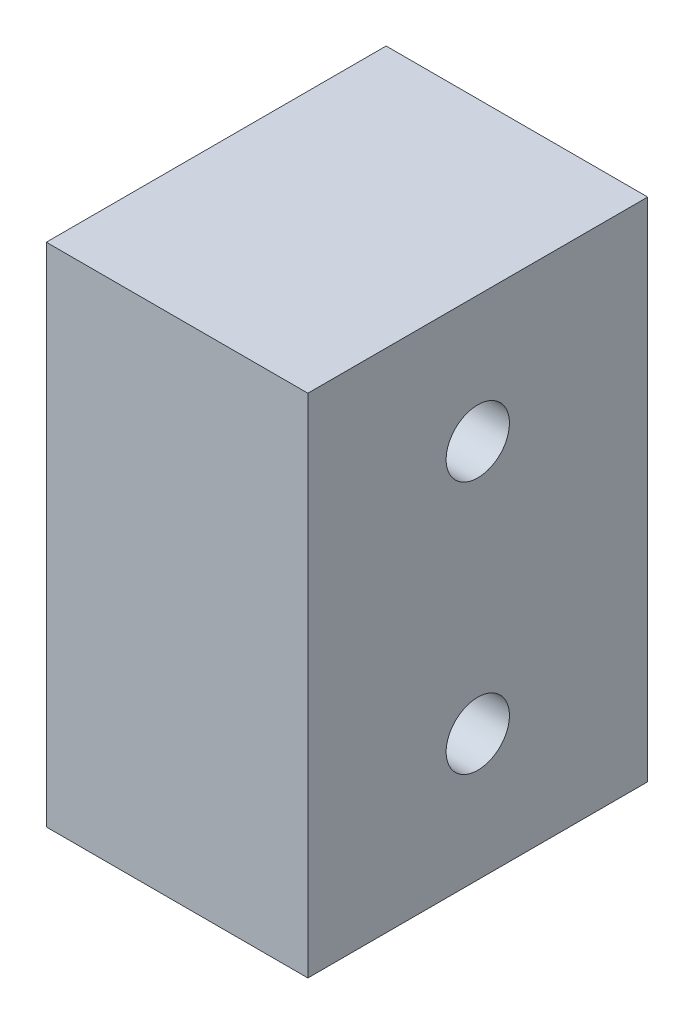
ISO-10303-21;
HEADER;
FILE_DESCRIPTION(('STEP AP214'),'2;1');
FILE_NAME('part.step','',(''),(''),'','','');
FILE_SCHEMA(('AUTOMOTIVE_DESIGN { 1 0 10303 214 1 1 1 1 }'));
ENDSEC;
DATA;
#1=APPLICATION_CONTEXT('core data for automotive mechanical design processes');
#2=APPLICATION_PROTOCOL_DEFINITION('international standard','automotive_design',2000,#1);
#3=PRODUCT_CONTEXT('',#1,'mechanical');
#4=PRODUCT('Part','Part','',(#3));
#5=PRODUCT_RELATED_PRODUCT_CATEGORY('part','',(#4));
#6=PRODUCT_DEFINITION_FORMATION('','',#4);
#7=PRODUCT_DEFINITION_CONTEXT('part definition',#1,'design');
#8=PRODUCT_DEFINITION('design','',#6,#7);
#9=PRODUCT_DEFINITION_SHAPE('','',#8);
#10=(LENGTH_UNIT() NAMED_UNIT(*) SI_UNIT(.MILLI.,.METRE.));
#11=(NAMED_UNIT(*) PLANE_ANGLE_UNIT() SI_UNIT($,.RADIAN.));
#12=(NAMED_UNIT(*) SI_UNIT($,.STERADIAN.) SOLID_ANGLE_UNIT());
#13=UNCERTAINTY_MEASURE_WITH_UNIT(LENGTH_MEASURE(1.E-05),#10,'distance_accuracy_value','');
#14=(GEOMETRIC_REPRESENTATION_CONTEXT(3) GLOBAL_UNCERTAINTY_ASSIGNED_CONTEXT((#13)) GLOBAL_UNIT_ASSIGNED_CONTEXT((#10,
#11,#12)) REPRESENTATION_CONTEXT('',''));
#15=CARTESIAN_POINT('',(0.,0.,0.));
#16=DIRECTION('',(0.,0.,1.));
#17=DIRECTION('',(1.,0.,0.));
#18=AXIS2_PLACEMENT_3D('',#15,#16,#17);
#19=CARTESIAN_POINT('',(10.33,-10.,6.71));
#20=DIRECTION('',(0.,1.,0.));
#21=DIRECTION('',(0.,0.,1.));
#22=AXIS2_PLACEMENT_3D('',#19,#20,#21);
#23=PLANE('',#22);
#24=DIRECTION('',(0.,0.,-1.));
#25=VECTOR('',#24,1.);
#26=CARTESIAN_POINT('',(0.,-10.,6.71));
#27=LINE('',#26,#25);
#28=CARTESIAN_POINT('',(0.,-10.,6.71));
#29=VERTEX_POINT('',#28);
#30=CARTESIAN_POINT('',(0.,-10.,-6.71));
#31=VERTEX_POINT('',#30);
#32=EDGE_CURVE('E113',#29,#31,#27,.T.);
#33=ORIENTED_EDGE('',*,*,#32,.T.);
#34=DIRECTION('',(-1.,0.,0.));
#35=VECTOR('',#34,1.);
#36=CARTESIAN_POINT('',(10.33,-10.,-6.71));
#37=LINE('',#36,#35);
#38=CARTESIAN_POINT('',(10.33,-10.,-6.71));
#39=VERTEX_POINT('',#38);
#40=EDGE_CURVE('E11',#39,#31,#37,.T.);
#41=ORIENTED_EDGE('',*,*,#40,.F.);
#42=DIRECTION('',(0.,0.,-1.));
#43=VECTOR('',#42,1.);
#44=CARTESIAN_POINT('',(10.33,-10.,6.71));
#45=LINE('',#44,#43);
#46=CARTESIAN_POINT('',(10.33,-10.,6.71));
#47=VERTEX_POINT('',#46);
#48=EDGE_CURVE('E97',#47,#39,#45,.T.);
#49=ORIENTED_EDGE('',*,*,#48,.F.);
#50=DIRECTION('',(-1.,0.,0.));
#51=VECTOR('',#50,1.);
#52=CARTESIAN_POINT('',(10.33,-10.,6.71));
#53=LINE('',#52,#51);
#54=EDGE_CURVE('E109',#47,#29,#53,.T.);
#55=ORIENTED_EDGE('',*,*,#54,.T.);
#56=EDGE_LOOP('',(#33,#41,#49,#55));
#57=FACE_BOUND('',#56,.T.);
#58=ADVANCED_FACE('F45',(#57),#23,.F.);
#59=CARTESIAN_POINT('',(10.33,10.,-6.71));
#60=DIRECTION('',(0.,0.,1.));
#61=DIRECTION('',(0.,-1.,0.));
#62=AXIS2_PLACEMENT_3D('',#59,#60,#61);
#63=PLANE('',#62);
#64=DIRECTION('',(0.,1.,0.));
#65=VECTOR('',#64,1.);
#66=CARTESIAN_POINT('',(0.,10.,-6.71));
#67=LINE('',#66,#65);
#68=CARTESIAN_POINT('',(0.,10.,-6.71));
#69=VERTEX_POINT('',#68);
#70=EDGE_CURVE('E102',#31,#69,#67,.T.);
#71=ORIENTED_EDGE('',*,*,#70,.T.);
#72=DIRECTION('',(-1.,0.,0.));
#73=VECTOR('',#72,1.);
#74=CARTESIAN_POINT('',(10.33,10.,-6.71));
#75=LINE('',#74,#73);
#76=CARTESIAN_POINT('',(10.33,10.,-6.71));
#77=VERTEX_POINT('',#76);
#78=EDGE_CURVE('E54',#77,#69,#75,.T.);
#79=ORIENTED_EDGE('',*,*,#78,.F.);
#80=DIRECTION('',(0.,1.,0.));
#81=VECTOR('',#80,1.);
#82=CARTESIAN_POINT('',(10.33,10.,-6.71));
#83=LINE('',#82,#81);
#84=EDGE_CURVE('E92',#39,#77,#83,.T.);
#85=ORIENTED_EDGE('',*,*,#84,.F.);
#86=ORIENTED_EDGE('',*,*,#40,.T.);
#87=EDGE_LOOP('',(#71,#79,#85,#86));
#88=FACE_BOUND('',#87,.T.);
#89=ADVANCED_FACE('F101',(#88),#63,.F.);
#90=CARTESIAN_POINT('',(10.33,10.,6.71));
#91=DIRECTION('',(0.,-1.,0.));
#92=DIRECTION('',(0.,0.,-1.));
#93=AXIS2_PLACEMENT_3D('',#90,#91,#92);
#94=PLANE('',#93);
#95=DIRECTION('',(0.,0.,1.));
#96=VECTOR('',#95,1.);
#97=CARTESIAN_POINT('',(0.,10.,6.71));
#98=LINE('',#97,#96);
#99=CARTESIAN_POINT('',(0.,10.,6.71));
#100=VERTEX_POINT('',#99);
#101=EDGE_CURVE('E79',#69,#100,#98,.T.);
#102=ORIENTED_EDGE('',*,*,#101,.T.);
#103=DIRECTION('',(-1.,0.,0.));
#104=VECTOR('',#103,1.);
#105=CARTESIAN_POINT('',(10.33,10.,6.71));
#106=LINE('',#105,#104);
#107=CARTESIAN_POINT('',(10.33,10.,6.71));
#108=VERTEX_POINT('',#107);
#109=EDGE_CURVE('E104',#108,#100,#106,.T.);
#110=ORIENTED_EDGE('',*,*,#109,.F.);
#111=DIRECTION('',(0.,0.,1.));
#112=VECTOR('',#111,1.);
#113=CARTESIAN_POINT('',(10.33,10.,6.71));
#114=LINE('',#113,#112);
#115=EDGE_CURVE('E95',#77,#108,#114,.T.);
#116=ORIENTED_EDGE('',*,*,#115,.F.);
#117=ORIENTED_EDGE('',*,*,#78,.T.);
#118=EDGE_LOOP('',(#102,#110,#116,#117));
#119=FACE_BOUND('',#118,.T.);
#120=ADVANCED_FACE('F105',(#119),#94,.F.);
#121=CARTESIAN_POINT('',(10.33,10.,6.71));
#122=DIRECTION('',(0.,0.,-1.));
#123=DIRECTION('',(0.,1.,0.));
#124=AXIS2_PLACEMENT_3D('',#121,#122,#123);
#125=PLANE('',#124);
#126=DIRECTION('',(0.,-1.,0.));
#127=VECTOR('',#126,1.);
#128=CARTESIAN_POINT('',(0.,10.,6.71));
#129=LINE('',#128,#127);
#130=EDGE_CURVE('E85',#100,#29,#129,.T.);
#131=ORIENTED_EDGE('',*,*,#130,.T.);
#132=ORIENTED_EDGE('',*,*,#54,.F.);
#133=DIRECTION('',(0.,-1.,0.));
#134=VECTOR('',#133,1.);
#135=CARTESIAN_POINT('',(10.33,10.,6.71));
#136=LINE('',#135,#134);
#137=EDGE_CURVE('E62',#108,#47,#136,.T.);
#138=ORIENTED_EDGE('',*,*,#137,.F.);
#139=ORIENTED_EDGE('',*,*,#109,.T.);
#140=EDGE_LOOP('',(#131,#132,#138,#139));
#141=FACE_BOUND('',#140,.T.);
#142=ADVANCED_FACE('F127',(#141),#125,.F.);
#143=CARTESIAN_POINT('',(10.33,0.,0.));
#144=DIRECTION('',(-1.,0.,0.));
#145=DIRECTION('',(0.,0.,1.));
#146=AXIS2_PLACEMENT_3D('',#143,#144,#145);
#147=PLANE('',#146);
#148=CARTESIAN_POINT('',(10.33,5.,0.));
#149=DIRECTION('',(1.,0.,0.));
#150=DIRECTION('',(0.,0.,-1.));
#151=AXIS2_PLACEMENT_3D('',#148,#149,#150);
#152=CIRCLE('',#151,1.25);
#153=CARTESIAN_POINT('',(10.33,5.,-1.25));
#154=VERTEX_POINT('',#153);
#155=EDGE_CURVE('E142',#154,#154,#152,.T.);
#156=ORIENTED_EDGE('',*,*,#155,.F.);
#157=EDGE_LOOP('',(#156));
#158=FACE_BOUND('',#157,.T.);
#159=CARTESIAN_POINT('',(10.33,-5.,0.));
#160=DIRECTION('',(1.,0.,0.));
#161=DIRECTION('',(0.,0.,-1.));
#162=AXIS2_PLACEMENT_3D('',#159,#160,#161);
#163=CIRCLE('',#162,1.25);
#164=CARTESIAN_POINT('',(10.33,-5.,-1.25));
#165=VERTEX_POINT('',#164);
#166=EDGE_CURVE('E138',#165,#165,#163,.T.);
#167=ORIENTED_EDGE('',*,*,#166,.F.);
#168=EDGE_LOOP('',(#167));
#169=FACE_BOUND('',#168,.T.);
#170=ORIENTED_EDGE('',*,*,#48,.T.);
#171=ORIENTED_EDGE('',*,*,#84,.T.);
#172=ORIENTED_EDGE('',*,*,#115,.T.);
#173=ORIENTED_EDGE('',*,*,#137,.T.);
#174=EDGE_LOOP('',(#170,#171,#172,#173));
#175=FACE_BOUND('',#174,.T.);
#176=ADVANCED_FACE('F93',(#158,#169,#175),#147,.F.);
#177=CARTESIAN_POINT('',(0.,0.,0.));
#178=DIRECTION('',(-1.,0.,0.));
#179=DIRECTION('',(0.,0.,1.));
#180=AXIS2_PLACEMENT_3D('',#177,#178,#179);
#181=PLANE('',#180);
#182=CARTESIAN_POINT('',(0.,5.,0.));
#183=DIRECTION('',(1.,0.,0.));
#184=DIRECTION('',(0.,0.,-1.));
#185=AXIS2_PLACEMENT_3D('',#182,#183,#184);
#186=CIRCLE('',#185,1.25);
#187=CARTESIAN_POINT('',(0.,5.,-1.25));
#188=VERTEX_POINT('',#187);
#189=EDGE_CURVE('E117',#188,#188,#186,.T.);
#190=ORIENTED_EDGE('',*,*,#189,.T.);
#191=EDGE_LOOP('',(#190));
#192=FACE_BOUND('',#191,.T.);
#193=CARTESIAN_POINT('',(0.,-5.,0.));
#194=DIRECTION('',(1.,0.,0.));
#195=DIRECTION('',(0.,0.,-1.));
#196=AXIS2_PLACEMENT_3D('',#193,#194,#195);
#197=CIRCLE('',#196,1.25);
#198=CARTESIAN_POINT('',(0.,-5.,-1.25));
#199=VERTEX_POINT('',#198);
#200=EDGE_CURVE('E134',#199,#199,#197,.T.);
#201=ORIENTED_EDGE('',*,*,#200,.T.);
#202=EDGE_LOOP('',(#201));
#203=FACE_BOUND('',#202,.T.);
#204=ORIENTED_EDGE('',*,*,#32,.F.);
#205=ORIENTED_EDGE('',*,*,#130,.F.);
#206=ORIENTED_EDGE('',*,*,#101,.F.);
#207=ORIENTED_EDGE('',*,*,#70,.F.);
#208=EDGE_LOOP('',(#204,#205,#206,#207));
#209=FACE_BOUND('',#208,.T.);
#210=ADVANCED_FACE('F130',(#192,#203,#209),#181,.T.);
#211=CARTESIAN_POINT('',(0.,-5.,0.));
#212=DIRECTION('',(1.,0.,0.));
#213=DIRECTION('',(0.,0.,-1.));
#214=AXIS2_PLACEMENT_3D('',#211,#212,#213);
#215=CYLINDRICAL_SURFACE('',#214,1.25);
#216=ORIENTED_EDGE('',*,*,#200,.F.);
#217=EDGE_LOOP('',(#216));
#218=FACE_BOUND('',#217,.T.);
#219=ORIENTED_EDGE('',*,*,#166,.T.);
#220=EDGE_LOOP('',(#219));
#221=FACE_BOUND('',#220,.T.);
#222=ADVANCED_FACE('F155',(#218,#221),#215,.F.);
#223=CARTESIAN_POINT('',(0.,5.,0.));
#224=DIRECTION('',(1.,0.,0.));
#225=DIRECTION('',(0.,0.,-1.));
#226=AXIS2_PLACEMENT_3D('',#223,#224,#225);
#227=CYLINDRICAL_SURFACE('',#226,1.25);
#228=ORIENTED_EDGE('',*,*,#189,.F.);
#229=EDGE_LOOP('',(#228));
#230=FACE_BOUND('',#229,.T.);
#231=ORIENTED_EDGE('',*,*,#155,.T.);
#232=EDGE_LOOP('',(#231));
#233=FACE_BOUND('',#232,.T.);
#234=ADVANCED_FACE('F152',(#230,#233),#227,.F.);
#235=CLOSED_SHELL('',(#58,#89,#120,#142,#176,#210,#222,#234));
#236=MANIFOLD_SOLID_BREP('B2',#235);
#237=ADVANCED_BREP_SHAPE_REPRESENTATION('',(#18,#236),#14);
#238=SHAPE_DEFINITION_REPRESENTATION(#9,#237);
ENDSEC;
END-ISO-10303-21;
